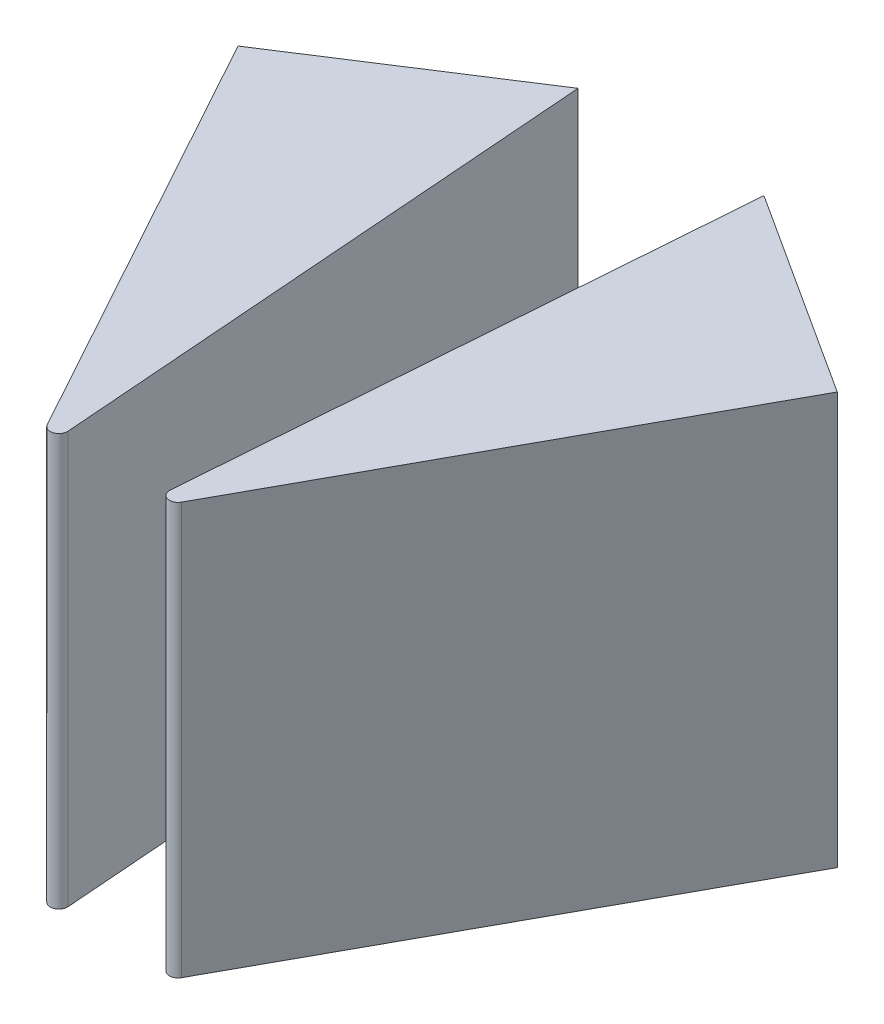
ISO-10303-21;
HEADER;
FILE_DESCRIPTION(('STEP AP214'),'2;1');
FILE_NAME('part.step','',(''),(''),'','','');
FILE_SCHEMA(('AUTOMOTIVE_DESIGN { 1 0 10303 214 1 1 1 1 }'));
ENDSEC;
DATA;
#1=APPLICATION_CONTEXT('core data for automotive mechanical design processes');
#2=APPLICATION_PROTOCOL_DEFINITION('international standard','automotive_design',2000,#1);
#3=PRODUCT_CONTEXT('',#1,'mechanical');
#4=PRODUCT('Part','Part','',(#3));
#5=PRODUCT_RELATED_PRODUCT_CATEGORY('part','',(#4));
#6=PRODUCT_DEFINITION_FORMATION('','',#4);
#7=PRODUCT_DEFINITION_CONTEXT('part definition',#1,'design');
#8=PRODUCT_DEFINITION('design','',#6,#7);
#9=PRODUCT_DEFINITION_SHAPE('','',#8);
#10=(LENGTH_UNIT() NAMED_UNIT(*) SI_UNIT(.MILLI.,.METRE.));
#11=(NAMED_UNIT(*) PLANE_ANGLE_UNIT() SI_UNIT($,.RADIAN.));
#12=(NAMED_UNIT(*) SI_UNIT($,.STERADIAN.) SOLID_ANGLE_UNIT());
#13=UNCERTAINTY_MEASURE_WITH_UNIT(LENGTH_MEASURE(1.E-05),#10,'distance_accuracy_value','');
#14=(GEOMETRIC_REPRESENTATION_CONTEXT(3) GLOBAL_UNCERTAINTY_ASSIGNED_CONTEXT((#13)) GLOBAL_UNIT_ASSIGNED_CONTEXT((#10,
#11,#12)) REPRESENTATION_CONTEXT('',''));
#15=CARTESIAN_POINT('',(0.,0.,0.));
#16=DIRECTION('',(0.,0.,1.));
#17=DIRECTION('',(1.,0.,0.));
#18=AXIS2_PLACEMENT_3D('',#15,#16,#17);
#19=CARTESIAN_POINT('',(-13.5406249364401,60.,-3.62304591300272));
#20=DIRECTION('',(0.542236756650994,0.,0.840225743319383));
#21=DIRECTION('',(-0.840225743319383,0.,0.542236756650994));
#22=AXIS2_PLACEMENT_3D('',#19,#20,#21);
#23=PLANE('',#22);
#24=DIRECTION('',(0.840225743319383,0.,-0.542236756650994));
#25=VECTOR('',#24,1.);
#26=CARTESIAN_POINT('',(-13.5406249364401,0.,-3.62304591300272));
#27=LINE('',#26,#25);
#28=CARTESIAN_POINT('',(-43.6477778781481,0.,15.8065003641836));
#29=VERTEX_POINT('',#28);
#30=CARTESIAN_POINT('',(-13.5406249364401,0.,-3.62304591300272));
#31=VERTEX_POINT('',#30);
#32=EDGE_CURVE('E106',#29,#31,#27,.T.);
#33=ORIENTED_EDGE('',*,*,#32,.F.);
#34=DIRECTION('',(0.,-1.,0.));
#35=VECTOR('',#34,1.);
#36=CARTESIAN_POINT('',(-43.6477778781481,60.,15.8065003641836));
#37=LINE('',#36,#35);
#38=CARTESIAN_POINT('',(-43.6477778781481,60.,15.8065003641836));
#39=VERTEX_POINT('',#38);
#40=EDGE_CURVE('E105',#39,#29,#37,.T.);
#41=ORIENTED_EDGE('',*,*,#40,.F.);
#42=DIRECTION('',(0.840225743319383,0.,-0.542236756650994));
#43=VECTOR('',#42,1.);
#44=CARTESIAN_POINT('',(-13.5406249364401,60.,-3.62304591300272));
#45=LINE('',#44,#43);
#46=CARTESIAN_POINT('',(-13.5406249364401,60.,-3.62304591300272));
#47=VERTEX_POINT('',#46);
#48=EDGE_CURVE('E100',#39,#47,#45,.T.);
#49=ORIENTED_EDGE('',*,*,#48,.T.);
#50=DIRECTION('',(0.,-1.,0.));
#51=VECTOR('',#50,1.);
#52=CARTESIAN_POINT('',(-13.5406249364401,60.,-3.62304591300272));
#53=LINE('',#52,#51);
#54=EDGE_CURVE('E12',#47,#31,#53,.T.);
#55=ORIENTED_EDGE('',*,*,#54,.T.);
#56=EDGE_LOOP('',(#33,#41,#49,#55));
#57=FACE_BOUND('',#56,.T.);
#58=ADVANCED_FACE('F43',(#57),#23,.F.);
#59=CARTESIAN_POINT('',(-13.5406249364401,60.,-3.62304591300272));
#60=DIRECTION('',(-0.99713014589225,0.,0.0757064868614295));
#61=DIRECTION('',(-0.0757064868614295,0.,-0.99713014589225));
#62=AXIS2_PLACEMENT_3D('',#59,#60,#61);
#63=PLANE('',#62);
#64=DIRECTION('',(0.0757064868614295,0.,0.99713014589225));
#65=VECTOR('',#64,1.);
#66=CARTESIAN_POINT('',(-13.5406249364401,0.,-3.62304591300272));
#67=LINE('',#66,#65);
#68=CARTESIAN_POINT('',(-7.43698918251043,0.,76.7679412018647));
#69=VERTEX_POINT('',#68);
#70=EDGE_CURVE('E108',#31,#69,#67,.T.);
#71=ORIENTED_EDGE('',*,*,#70,.F.);
#72=ORIENTED_EDGE('',*,*,#54,.F.);
#73=DIRECTION('',(0.0757064868614295,0.,0.99713014589225));
#74=VECTOR('',#73,1.);
#75=CARTESIAN_POINT('',(-13.5406249364401,60.,-3.62304591300272));
#76=LINE('',#75,#74);
#77=CARTESIAN_POINT('',(-7.43698918251043,60.,76.7679412018647));
#78=VERTEX_POINT('',#77);
#79=EDGE_CURVE('E84',#47,#78,#76,.T.);
#80=ORIENTED_EDGE('',*,*,#79,.T.);
#81=DIRECTION('',(0.,-1.,0.));
#82=VECTOR('',#81,1.);
#83=CARTESIAN_POINT('',(-7.43698918251043,60.,76.7679412018647));
#84=LINE('',#83,#82);
#85=EDGE_CURVE('E51',#78,#69,#84,.T.);
#86=ORIENTED_EDGE('',*,*,#85,.T.);
#87=EDGE_LOOP('',(#71,#72,#80,#86));
#88=FACE_BOUND('',#87,.T.);
#89=ADVANCED_FACE('F98',(#88),#63,.F.);
#90=CARTESIAN_POINT('',(-8.68340186487573,60.,76.8625743104415));
#91=DIRECTION('',(0.,-1.,0.));
#92=DIRECTION('',(0.,0.,-1.));
#93=AXIS2_PLACEMENT_3D('',#90,#91,#92);
#94=CYLINDRICAL_SURFACE('',#93,1.25);
#95=CARTESIAN_POINT('',(-8.68340186487573,0.,76.8625743104415));
#96=DIRECTION('',(0.,-1.,0.));
#97=DIRECTION('',(0.,0.,1.));
#98=AXIS2_PLACEMENT_3D('',#95,#96,#97);
#99=CIRCLE('',#98,1.25);
#100=CARTESIAN_POINT('',(-9.77899463133059,0.,77.4643853190578));
#101=VERTEX_POINT('',#100);
#102=EDGE_CURVE('E94',#69,#101,#99,.T.);
#103=ORIENTED_EDGE('',*,*,#102,.F.);
#104=ORIENTED_EDGE('',*,*,#85,.F.);
#105=CARTESIAN_POINT('',(-8.68340186487573,60.,76.8625743104415));
#106=DIRECTION('',(0.,-1.,0.));
#107=DIRECTION('',(0.,0.,1.));
#108=AXIS2_PLACEMENT_3D('',#105,#106,#107);
#109=CIRCLE('',#108,1.25);
#110=CARTESIAN_POINT('',(-9.77899463133059,60.,77.4643853190578));
#111=VERTEX_POINT('',#110);
#112=EDGE_CURVE('E87',#78,#111,#109,.T.);
#113=ORIENTED_EDGE('',*,*,#112,.T.);
#114=DIRECTION('',(0.,-1.,0.));
#115=VECTOR('',#114,1.);
#116=CARTESIAN_POINT('',(-9.77899463133059,60.,77.4643853190578));
#117=LINE('',#116,#115);
#118=EDGE_CURVE('E97',#111,#101,#117,.T.);
#119=ORIENTED_EDGE('',*,*,#118,.T.);
#120=EDGE_LOOP('',(#103,#104,#113,#119));
#121=FACE_BOUND('',#120,.T.);
#122=ADVANCED_FACE('F93',(#121),#94,.T.);
#123=CARTESIAN_POINT('',(-43.6477778781481,60.,15.8065003641836));
#124=DIRECTION('',(0.876474213163892,0.,-0.481448806893044));
#125=DIRECTION('',(0.481448806893044,0.,0.876474213163892));
#126=AXIS2_PLACEMENT_3D('',#123,#124,#125);
#127=PLANE('',#126);
#128=DIRECTION('',(-0.481448806893044,0.,-0.876474213163892));
#129=VECTOR('',#128,1.);
#130=CARTESIAN_POINT('',(-43.6477778781481,0.,15.8065003641836));
#131=LINE('',#130,#129);
#132=EDGE_CURVE('E73',#101,#29,#131,.T.);
#133=ORIENTED_EDGE('',*,*,#132,.F.);
#134=ORIENTED_EDGE('',*,*,#118,.F.);
#135=DIRECTION('',(-0.481448806893044,0.,-0.876474213163892));
#136=VECTOR('',#135,1.);
#137=CARTESIAN_POINT('',(-43.6477778781481,60.,15.8065003641836));
#138=LINE('',#137,#136);
#139=EDGE_CURVE('E59',#111,#39,#138,.T.);
#140=ORIENTED_EDGE('',*,*,#139,.T.);
#141=ORIENTED_EDGE('',*,*,#40,.T.);
#142=EDGE_LOOP('',(#133,#134,#140,#141));
#143=FACE_BOUND('',#142,.T.);
#144=ADVANCED_FACE('F117',(#143),#127,.F.);
#145=CARTESIAN_POINT('',(-8.68340186487573,60.,76.8625743104415));
#146=DIRECTION('',(0.,1.,0.));
#147=DIRECTION('',(0.,0.,1.));
#148=AXIS2_PLACEMENT_3D('',#145,#146,#147);
#149=PLANE('',#148);
#150=ORIENTED_EDGE('',*,*,#48,.F.);
#151=ORIENTED_EDGE('',*,*,#139,.F.);
#152=ORIENTED_EDGE('',*,*,#112,.F.);
#153=ORIENTED_EDGE('',*,*,#79,.F.);
#154=EDGE_LOOP('',(#150,#151,#152,#153));
#155=FACE_BOUND('',#154,.T.);
#156=ADVANCED_FACE('F89',(#155),#149,.T.);
#157=CARTESIAN_POINT('',(-8.68340186487573,0.,76.8625743104415));
#158=DIRECTION('',(0.,1.,0.));
#159=DIRECTION('',(0.,0.,1.));
#160=AXIS2_PLACEMENT_3D('',#157,#158,#159);
#161=PLANE('',#160);
#162=ORIENTED_EDGE('',*,*,#32,.T.);
#163=ORIENTED_EDGE('',*,*,#70,.T.);
#164=ORIENTED_EDGE('',*,*,#102,.T.);
#165=ORIENTED_EDGE('',*,*,#132,.T.);
#166=EDGE_LOOP('',(#162,#163,#164,#165));
#167=FACE_BOUND('',#166,.T.);
#168=ADVANCED_FACE('F113',(#167),#161,.F.);
#169=CLOSED_SHELL('',(#58,#89,#122,#144,#156,#168));
#170=MANIFOLD_SOLID_BREP('B2',#169);
#171=CARTESIAN_POINT('',(13.5406249364401,60.,-3.62304591300272));
#172=DIRECTION('',(-0.542236756650994,0.,0.840225743319383));
#173=DIRECTION('',(0.840225743319383,0.,0.542236756650994));
#174=AXIS2_PLACEMENT_3D('',#171,#172,#173);
#175=PLANE('',#174);
#176=DIRECTION('',(-0.840225743319383,0.,-0.542236756650994));
#177=VECTOR('',#176,1.);
#178=CARTESIAN_POINT('',(13.5406249364401,0.,-3.62304591300272));
#179=LINE('',#178,#177);
#180=CARTESIAN_POINT('',(43.6477778781481,0.,15.8065003641836));
#181=VERTEX_POINT('',#180);
#182=CARTESIAN_POINT('',(13.5406249364401,0.,-3.62304591300272));
#183=VERTEX_POINT('',#182);
#184=EDGE_CURVE('E230',#181,#183,#179,.T.);
#185=ORIENTED_EDGE('',*,*,#184,.T.);
#186=DIRECTION('',(0.,-1.,0.));
#187=VECTOR('',#186,1.);
#188=CARTESIAN_POINT('',(13.5406249364401,60.,-3.62304591300272));
#189=LINE('',#188,#187);
#190=CARTESIAN_POINT('',(13.5406249364401,60.,-3.62304591300272));
#191=VERTEX_POINT('',#190);
#192=EDGE_CURVE('E41',#191,#183,#189,.T.);
#193=ORIENTED_EDGE('',*,*,#192,.F.);
#194=DIRECTION('',(-0.840225743319383,0.,-0.542236756650994));
#195=VECTOR('',#194,1.);
#196=CARTESIAN_POINT('',(13.5406249364401,60.,-3.62304591300272));
#197=LINE('',#196,#195);
#198=CARTESIAN_POINT('',(43.6477778781481,60.,15.8065003641836));
#199=VERTEX_POINT('',#198);
#200=EDGE_CURVE('E218',#199,#191,#197,.T.);
#201=ORIENTED_EDGE('',*,*,#200,.F.);
#202=DIRECTION('',(0.,-1.,0.));
#203=VECTOR('',#202,1.);
#204=CARTESIAN_POINT('',(43.6477778781481,60.,15.8065003641836));
#205=LINE('',#204,#203);
#206=EDGE_CURVE('E226',#199,#181,#205,.T.);
#207=ORIENTED_EDGE('',*,*,#206,.T.);
#208=EDGE_LOOP('',(#185,#193,#201,#207));
#209=FACE_BOUND('',#208,.T.);
#210=ADVANCED_FACE('F167',(#209),#175,.F.);
#211=CARTESIAN_POINT('',(13.5406249364401,60.,-3.62304591300272));
#212=DIRECTION('',(0.99713014589225,0.,0.0757064868614295));
#213=DIRECTION('',(0.0757064868614295,0.,-0.99713014589225));
#214=AXIS2_PLACEMENT_3D('',#211,#212,#213);
#215=PLANE('',#214);
#216=DIRECTION('',(-0.0757064868614295,0.,0.99713014589225));
#217=VECTOR('',#216,1.);
#218=CARTESIAN_POINT('',(13.5406249364401,0.,-3.62304591300272));
#219=LINE('',#218,#217);
#220=CARTESIAN_POINT('',(7.43698918251043,0.,76.7679412018647));
#221=VERTEX_POINT('',#220);
#222=EDGE_CURVE('E222',#183,#221,#219,.T.);
#223=ORIENTED_EDGE('',*,*,#222,.T.);
#224=DIRECTION('',(0.,-1.,0.));
#225=VECTOR('',#224,1.);
#226=CARTESIAN_POINT('',(7.43698918251043,60.,76.7679412018647));
#227=LINE('',#226,#225);
#228=CARTESIAN_POINT('',(7.43698918251043,60.,76.7679412018647));
#229=VERTEX_POINT('',#228);
#230=EDGE_CURVE('E175',#229,#221,#227,.T.);
#231=ORIENTED_EDGE('',*,*,#230,.F.);
#232=DIRECTION('',(-0.0757064868614295,0.,0.99713014589225));
#233=VECTOR('',#232,1.);
#234=CARTESIAN_POINT('',(13.5406249364401,60.,-3.62304591300272));
#235=LINE('',#234,#233);
#236=EDGE_CURVE('E213',#191,#229,#235,.T.);
#237=ORIENTED_EDGE('',*,*,#236,.F.);
#238=ORIENTED_EDGE('',*,*,#192,.T.);
#239=EDGE_LOOP('',(#223,#231,#237,#238));
#240=FACE_BOUND('',#239,.T.);
#241=ADVANCED_FACE('F221',(#240),#215,.F.);
#242=CARTESIAN_POINT('',(8.68340186487573,60.,76.8625743104415));
#243=DIRECTION('',(0.,-1.,0.));
#244=DIRECTION('',(0.,0.,-1.));
#245=AXIS2_PLACEMENT_3D('',#242,#243,#244);
#246=CYLINDRICAL_SURFACE('',#245,1.25);
#247=CARTESIAN_POINT('',(8.68340186487573,0.,76.8625743104415));
#248=DIRECTION('',(0.,1.,0.));
#249=DIRECTION('',(0.,0.,1.));
#250=AXIS2_PLACEMENT_3D('',#247,#248,#249);
#251=CIRCLE('',#250,1.25);
#252=CARTESIAN_POINT('',(9.77899463133059,0.,77.4643853190578));
#253=VERTEX_POINT('',#252);
#254=EDGE_CURVE('E200',#221,#253,#251,.T.);
#255=ORIENTED_EDGE('',*,*,#254,.T.);
#256=DIRECTION('',(0.,-1.,0.));
#257=VECTOR('',#256,1.);
#258=CARTESIAN_POINT('',(9.77899463133059,60.,77.4643853190578));
#259=LINE('',#258,#257);
#260=CARTESIAN_POINT('',(9.77899463133059,60.,77.4643853190578));
#261=VERTEX_POINT('',#260);
#262=EDGE_CURVE('E223',#261,#253,#259,.T.);
#263=ORIENTED_EDGE('',*,*,#262,.F.);
#264=CARTESIAN_POINT('',(8.68340186487573,60.,76.8625743104415));
#265=DIRECTION('',(0.,1.,0.));
#266=DIRECTION('',(0.,0.,1.));
#267=AXIS2_PLACEMENT_3D('',#264,#265,#266);
#268=CIRCLE('',#267,1.25);
#269=EDGE_CURVE('E216',#229,#261,#268,.T.);
#270=ORIENTED_EDGE('',*,*,#269,.F.);
#271=ORIENTED_EDGE('',*,*,#230,.T.);
#272=EDGE_LOOP('',(#255,#263,#270,#271));
#273=FACE_BOUND('',#272,.T.);
#274=ADVANCED_FACE('F224',(#273),#246,.T.);
#275=CARTESIAN_POINT('',(43.6477778781481,60.,15.8065003641836));
#276=DIRECTION('',(-0.876474213163892,0.,-0.481448806893044));
#277=DIRECTION('',(-0.481448806893044,0.,0.876474213163892));
#278=AXIS2_PLACEMENT_3D('',#275,#276,#277);
#279=PLANE('',#278);
#280=DIRECTION('',(0.481448806893044,0.,-0.876474213163892));
#281=VECTOR('',#280,1.);
#282=CARTESIAN_POINT('',(43.6477778781481,0.,15.8065003641836));
#283=LINE('',#282,#281);
#284=EDGE_CURVE('E206',#253,#181,#283,.T.);
#285=ORIENTED_EDGE('',*,*,#284,.T.);
#286=ORIENTED_EDGE('',*,*,#206,.F.);
#287=DIRECTION('',(0.481448806893044,0.,-0.876474213163892));
#288=VECTOR('',#287,1.);
#289=CARTESIAN_POINT('',(43.6477778781481,60.,15.8065003641836));
#290=LINE('',#289,#288);
#291=EDGE_CURVE('E183',#261,#199,#290,.T.);
#292=ORIENTED_EDGE('',*,*,#291,.F.);
#293=ORIENTED_EDGE('',*,*,#262,.T.);
#294=EDGE_LOOP('',(#285,#286,#292,#293));
#295=FACE_BOUND('',#294,.T.);
#296=ADVANCED_FACE('F237',(#295),#279,.F.);
#297=CARTESIAN_POINT('',(8.68340186487573,60.,76.8625743104415));
#298=DIRECTION('',(0.,1.,0.));
#299=DIRECTION('',(0.,0.,1.));
#300=AXIS2_PLACEMENT_3D('',#297,#298,#299);
#301=PLANE('',#300);
#302=ORIENTED_EDGE('',*,*,#200,.T.);
#303=ORIENTED_EDGE('',*,*,#236,.T.);
#304=ORIENTED_EDGE('',*,*,#269,.T.);
#305=ORIENTED_EDGE('',*,*,#291,.T.);
#306=EDGE_LOOP('',(#302,#303,#304,#305));
#307=FACE_BOUND('',#306,.T.);
#308=ADVANCED_FACE('F214',(#307),#301,.T.);
#309=CARTESIAN_POINT('',(8.68340186487573,0.,76.8625743104415));
#310=DIRECTION('',(0.,1.,0.));
#311=DIRECTION('',(0.,0.,1.));
#312=AXIS2_PLACEMENT_3D('',#309,#310,#311);
#313=PLANE('',#312);
#314=ORIENTED_EDGE('',*,*,#184,.F.);
#315=ORIENTED_EDGE('',*,*,#284,.F.);
#316=ORIENTED_EDGE('',*,*,#254,.F.);
#317=ORIENTED_EDGE('',*,*,#222,.F.);
#318=EDGE_LOOP('',(#314,#315,#316,#317));
#319=FACE_BOUND('',#318,.T.);
#320=ADVANCED_FACE('F240',(#319),#313,.F.);
#321=CLOSED_SHELL('',(#210,#241,#274,#296,#308,#320));
#322=MANIFOLD_SOLID_BREP('B6',#321);
#323=ADVANCED_BREP_SHAPE_REPRESENTATION('',(#18,#170,#322),#14);
#324=SHAPE_DEFINITION_REPRESENTATION(#9,#323);
ENDSEC;
END-ISO-10303-21;
